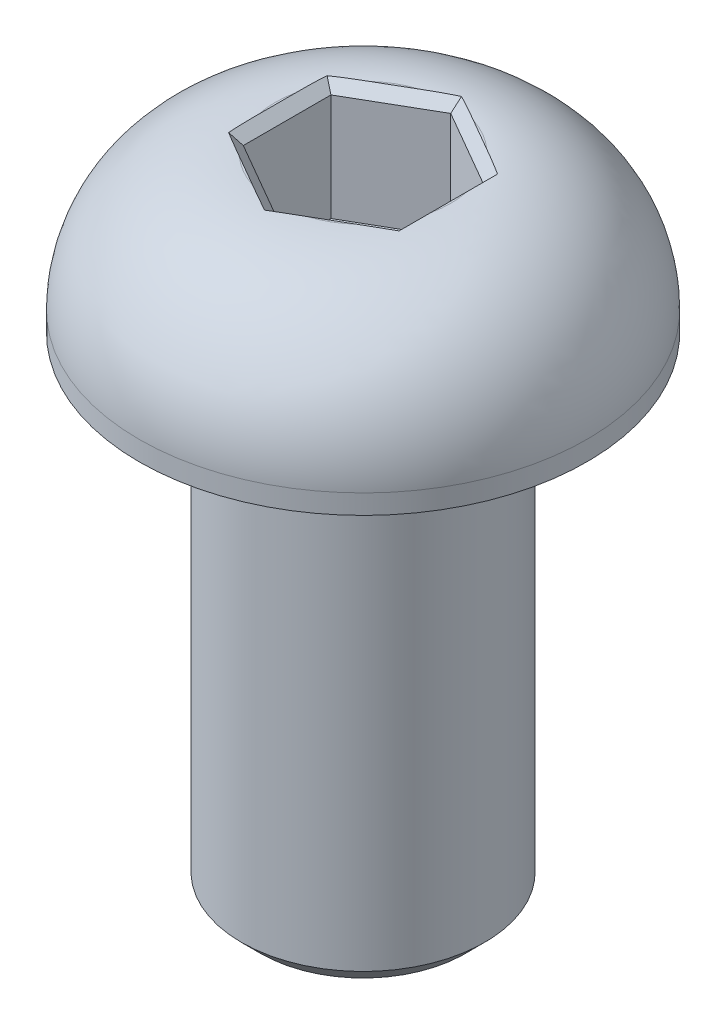
ISO-10303-21;
HEADER;
FILE_DESCRIPTION(('STEP AP214'),'2;1');
FILE_NAME('part.step','',(''),(''),'','','');
FILE_SCHEMA(('AUTOMOTIVE_DESIGN { 1 0 10303 214 1 1 1 1 }'));
ENDSEC;
DATA;
#1=APPLICATION_CONTEXT('core data for automotive mechanical design processes');
#2=APPLICATION_PROTOCOL_DEFINITION('international standard','automotive_design',2000,#1);
#3=PRODUCT_CONTEXT('',#1,'mechanical');
#4=PRODUCT('Part','Part','',(#3));
#5=PRODUCT_RELATED_PRODUCT_CATEGORY('part','',(#4));
#6=PRODUCT_DEFINITION_FORMATION('','',#4);
#7=PRODUCT_DEFINITION_CONTEXT('part definition',#1,'design');
#8=PRODUCT_DEFINITION('design','',#6,#7);
#9=PRODUCT_DEFINITION_SHAPE('','',#8);
#10=(LENGTH_UNIT() NAMED_UNIT(*) SI_UNIT(.MILLI.,.METRE.));
#11=(NAMED_UNIT(*) PLANE_ANGLE_UNIT() SI_UNIT($,.RADIAN.));
#12=(NAMED_UNIT(*) SI_UNIT($,.STERADIAN.) SOLID_ANGLE_UNIT());
#13=UNCERTAINTY_MEASURE_WITH_UNIT(LENGTH_MEASURE(1.E-05),#10,'distance_accuracy_value','');
#14=(GEOMETRIC_REPRESENTATION_CONTEXT(3) GLOBAL_UNCERTAINTY_ASSIGNED_CONTEXT((#13)) GLOBAL_UNIT_ASSIGNED_CONTEXT((#10,
#11,#12)) REPRESENTATION_CONTEXT('',''));
#15=CARTESIAN_POINT('',(0.,0.,0.));
#16=DIRECTION('',(0.,0.,1.));
#17=DIRECTION('',(1.,0.,0.));
#18=AXIS2_PLACEMENT_3D('',#15,#16,#17);
#19=CARTESIAN_POINT('',(2.23520000000001,0.,0.));
#20=DIRECTION('',(0.707106781186548,-0.707106781186548,0.));
#21=DIRECTION('',(0.707106781186548,0.707106781186548,0.));
#22=AXIS2_PLACEMENT_3D('',#19,#20,#21);
#23=PLANE('',#22);
#24=CARTESIAN_POINT('',(2.22399670617115,-0.0112032938288589,-1.28402509698474));
#25=CARTESIAN_POINT('',(2.22841135106006,-0.00678864893879202,-1.16554783242049));
#26=CARTESIAN_POINT('',(2.23110879962653,-0.00409120037287481,-1.04699639920592));
#27=CARTESIAN_POINT('',(2.23438345381033,-0.000816546190287566,-0.809850635730226));
#28=CARTESIAN_POINT('',(2.23496107929993,-0.000238920701353471,-0.691256318617618));
#29=CARTESIAN_POINT('',(2.23515898063711,-4.10193631359054E-05,-0.557099307855873));
#30=CARTESIAN_POINT('',(2.2351750070183,-2.49929817972814E-05,-0.541528977035806));
#31=CARTESIAN_POINT('',(2.23519554632668,-4.453673235457E-06,-0.510387894564967));
#32=CARTESIAN_POINT('',(2.23520005895435,5.89544553829237E-08,-0.494817142913786));
#33=CARTESIAN_POINT('',(2.23520000000001,0.,-0.479246241508439));
#34=B_SPLINE_CURVE_WITH_KNOTS('',3,(#24,#25,#26,#27,#28,#29,#30,#31,#32,#33),.UNSPECIFIED.,.F.,
.F.,(4,2,2,2,4),(0.,0.355828535544475,0.711586588509343,0.758297774785068,0.805010176248268),.UNSPECIFIED.);
#35=CARTESIAN_POINT('',(2.22399670617115,-0.0112032938288588,-1.28402509698474));
#36=VERTEX_POINT('',#35);
#37=CARTESIAN_POINT('',(2.23520000000001,0.,-0.479246241508439));
#38=VERTEX_POINT('',#37);
#39=EDGE_CURVE('E128',#36,#38,#34,.T.);
#40=ORIENTED_EDGE('',*,*,#39,.F.);
#41=DIRECTION('',(-0.654653670707975,-0.654653670707977,0.37796447300923));
#42=VECTOR('',#41,1.);
#43=CARTESIAN_POINT('',(2.22399670617115,-0.0112032938288602,-1.28402509698474));
#44=LINE('',#43,#42);
#45=CARTESIAN_POINT('',(1.98120000000001,-0.254,-1.14384635331848));
#46=VERTEX_POINT('',#45);
#47=EDGE_CURVE('E136',#36,#46,#44,.T.);
#48=ORIENTED_EDGE('',*,*,#47,.T.);
#49=DIRECTION('',(0.,0.,1.));
#50=VECTOR('',#49,1.);
#51=CARTESIAN_POINT('',(1.98120000000001,-0.254000000000001,-1.14384635331848));
#52=LINE('',#51,#50);
#53=CARTESIAN_POINT('',(1.98120000000001,-0.254000000000001,1.14384635331849));
#54=VERTEX_POINT('',#53);
#55=EDGE_CURVE('E223',#54,#46,#52,.F.);
#56=ORIENTED_EDGE('',*,*,#55,.F.);
#57=DIRECTION('',(0.654653670707976,0.654653670707977,0.377964473009229));
#58=VECTOR('',#57,1.);
#59=CARTESIAN_POINT('',(1.98120000000001,-0.254,1.14384635331849));
#60=LINE('',#59,#58);
#61=CARTESIAN_POINT('',(2.22399670617115,-0.0112032938288603,1.28402509698475));
#62=VERTEX_POINT('',#61);
#63=EDGE_CURVE('E186',#54,#62,#60,.T.);
#64=ORIENTED_EDGE('',*,*,#63,.T.);
#65=CARTESIAN_POINT('',(2.23520000000001,0.,0.479246241508439));
#66=CARTESIAN_POINT('',(2.23519208788843,-7.91211009480866E-06,0.597800715305684));
#67=CARTESIAN_POINT('',(2.23495349481257,-0.000246505186659069,0.716402395238539));
#68=CARTESIAN_POINT('',(2.23270241259373,-0.0024975874070557,0.953513904044191));
#69=CARTESIAN_POINT('',(2.23069069534341,-0.00450930465823549,1.0720237504285));
#70=CARTESIAN_POINT('',(2.2266687677988,-0.00853123220151168,1.20604578947156));
#71=CARTESIAN_POINT('',(2.22617387547318,-0.00902612452694535,1.22164382162402));
#72=CARTESIAN_POINT('',(2.22512799617112,-0.0100720038287759,1.25283701736964));
#73=CARTESIAN_POINT('',(2.22457700598046,-0.0106229940193991,1.26843218074709));
#74=CARTESIAN_POINT('',(2.22399670617115,-0.0112032938288599,1.28402509698475));
#75=B_SPLINE_CURVE_WITH_KNOTS('',3,(#65,#66,#67,#68,#69,#70,#71,#72,#73,#74),.UNSPECIFIED.,.F.,
.F.,(4,2,2,2,4),(0.,0.355743000096769,0.711331211340007,0.75817210537775,0.805015684759264),.UNSPECIFIED.);
#76=CARTESIAN_POINT('',(2.23520000000001,0.,0.479246241508439));
#77=VERTEX_POINT('',#76);
#78=EDGE_CURVE('E144',#77,#62,#75,.T.);
#79=ORIENTED_EDGE('',*,*,#78,.F.);
#80=DIRECTION('',(0.,0.,1.));
#81=VECTOR('',#80,1.);
#82=CARTESIAN_POINT('',(2.23520000000001,0.,0.));
#83=LINE('',#82,#81);
#84=EDGE_CURVE('E143',#38,#77,#83,.T.);
#85=ORIENTED_EDGE('',*,*,#84,.F.);
#86=EDGE_LOOP('',(#40,#48,#56,#64,#79,#85));
#87=FACE_BOUND('',#86,.T.);
#88=ADVANCED_FACE('F16',(#87),#23,.F.);
#89=CARTESIAN_POINT('',(1.1176,0.,1.93573998253899));
#90=DIRECTION('',(0.353553390593274,-0.707106781186548,0.612372435695794));
#91=DIRECTION('',(0.,-0.654653670707977,-0.755928946018455));
#92=AXIS2_PLACEMENT_3D('',#89,#90,#91);
#93=PLANE('',#92);
#94=CARTESIAN_POINT('',(0.70256058018549,0.,2.1753631032932));
#95=CARTESIAN_POINT('',(0.599885438088986,-7.91211009276454E-06,2.23463348810219));
#96=CARTESIAN_POINT('',(0.497054073797695,-0.000246505186657969,2.29372770040376));
#97=CARTESIAN_POINT('',(0.290583942532928,-0.00249758740705674,2.41033396041907));
#98=CARTESIAN_POINT('',(0.186945546340366,-0.00450930465823774,2.46784668536722));
#99=CARTESIAN_POINT('',(0.0688680920897798,-0.00853123220151213,2.53137461346293));
#100=CARTESIAN_POINT('',(0.0551123538338917,-0.00902612452694555,2.53874504021303));
#101=CARTESIAN_POINT('',(0.0275753142419301,-0.010072003828776,2.55343588004097));
#102=CARTESIAN_POINT('',(0.0137940114855596,-0.0106229940193992,2.56075629022735));
#103=CARTESIAN_POINT('',(0.,-0.0112032938288605,2.56805019396951));
#104=B_SPLINE_CURVE_WITH_KNOTS('',3,(#94,#95,#96,#97,#98,#99,#100,#101,#102,#103),.UNSPECIFIED.,
.F.,.F.,(4,2,2,2,4),(0.,0.35574300009677,0.711331211340008,0.758172105377752,0.805015684759268),.UNSPECIFIED.);
#105=CARTESIAN_POINT('',(0.70256058018549,0.,2.1753631032932));
#106=VERTEX_POINT('',#105);
#107=CARTESIAN_POINT('',(0.,-0.0112032938288596,2.5680501939695));
#108=VERTEX_POINT('',#107);
#109=EDGE_CURVE('E178',#106,#108,#104,.T.);
#110=ORIENTED_EDGE('',*,*,#109,.F.);
#111=DIRECTION('',(-0.866025403784439,0.,0.5));
#112=VECTOR('',#111,1.);
#113=CARTESIAN_POINT('',(1.53263941981452,0.,1.69611686178477));
#114=LINE('',#113,#112);
#115=CARTESIAN_POINT('',(1.53263941981452,0.,1.69611686178477));
#116=VERTEX_POINT('',#115);
#117=EDGE_CURVE('E181',#116,#106,#114,.T.);
#118=ORIENTED_EDGE('',*,*,#117,.F.);
#119=CARTESIAN_POINT('',(2.22399670617115,-0.01120329382886,1.28402509698475));
#120=CARTESIAN_POINT('',(2.12359970773207,-0.00678864893879016,1.34708692388936));
#121=CARTESIAN_POINT('',(2.02227987919643,-0.00409120037287398,1.40869869948061));
#122=CARTESIAN_POINT('',(1.81854295071853,-0.000816546190289203,1.53010751493024));
#123=CARTESIAN_POINT('',(1.71612607209935,-0.00023892070135656,1.58990491183442));
#124=CARTESIAN_POINT('',(1.60004164335248,-4.10193631366739E-05,1.65715480480073));
#125=CARTESIAN_POINT('',(1.58656535450756,-2.49929817977188E-05,1.664953849464));
#126=CARTESIAN_POINT('',(1.55960665564066,-4.4536732350329E-06,1.68054217826226));
#127=CARTESIAN_POINT('',(1.54612424546854,5.8954456337414E-08,1.68833146213805));
#128=CARTESIAN_POINT('',(1.53263941981452,0.,1.69611686178477));
#129=B_SPLINE_CURVE_WITH_KNOTS('',3,(#119,#120,#121,#122,#123,#124,#125,#126,#127,#128),
.UNSPECIFIED.,.F.,.F.,(4,2,2,2,4),(0.,0.355828535544475,0.711586588509342,0.758297774785077,
0.805010176248287),.UNSPECIFIED.);
#130=EDGE_CURVE('E183',#62,#116,#129,.T.);
#131=ORIENTED_EDGE('',*,*,#130,.F.);
#132=ORIENTED_EDGE('',*,*,#63,.F.);
#133=DIRECTION('',(-0.866025403784439,0.,0.5));
#134=VECTOR('',#133,1.);
#135=CARTESIAN_POINT('',(1.98120000000001,-0.254000000000001,1.14384635331849));
#136=LINE('',#135,#134);
#137=CARTESIAN_POINT('',(0.,-0.254000000000001,2.28769270663698));
#138=VERTEX_POINT('',#137);
#139=EDGE_CURVE('E225',#138,#54,#136,.F.);
#140=ORIENTED_EDGE('',*,*,#139,.F.);
#141=DIRECTION('',(0.,-0.654653670707977,-0.755928946018455));
#142=VECTOR('',#141,1.);
#143=CARTESIAN_POINT('',(0.,-0.319314285714288,2.21227426575883));
#144=LINE('',#143,#142);
#145=EDGE_CURVE('E175',#138,#108,#144,.F.);
#146=ORIENTED_EDGE('',*,*,#145,.T.);
#147=EDGE_LOOP('',(#110,#118,#131,#132,#140,#146));
#148=FACE_BOUND('',#147,.T.);
#149=ADVANCED_FACE('F483',(#148),#93,.F.);
#150=CARTESIAN_POINT('',(-1.1176,0.,1.93573998253898));
#151=DIRECTION('',(-0.353553390593274,-0.707106781186548,0.612372435695794));
#152=DIRECTION('',(0.,-0.654653670707977,-0.755928946018455));
#153=AXIS2_PLACEMENT_3D('',#150,#151,#152);
#154=PLANE('',#153);
#155=CARTESIAN_POINT('',(-1.53263941981454,0.,1.69611686178475));
#156=CARTESIAN_POINT('',(-1.63530664979946,-7.91211009375364E-06,1.6368327727965));
#157=CARTESIAN_POINT('',(-1.73789942101489,-0.000246505186658447,1.57732530516521));
#158=CARTESIAN_POINT('',(-1.94211847006083,-0.00249758740705628,1.45682005637487));
#159=CARTESIAN_POINT('',(-2.04374514900307,-0.00450930465823684,1.3958229349387));
#160=CARTESIAN_POINT('',(-2.15780067570904,-0.00853123220151208,1.32532882399136));
#161=CARTESIAN_POINT('',(-2.17106152163929,-0.0090261245269454,1.31710121858901));
#162=CARTESIAN_POINT('',(-2.19755268192919,-0.0100720038287754,1.30059886267133));
#163=CARTESIAN_POINT('',(-2.21078299449489,-0.0106229940193984,1.29232410948026));
#164=CARTESIAN_POINT('',(-2.22399670617113,-0.011203293828859,1.28402509698476));
#165=B_SPLINE_CURVE_WITH_KNOTS('',3,(#155,#156,#157,#158,#159,#160,#161,#162,#163,#164),
.UNSPECIFIED.,.F.,.F.,(4,2,2,2,4),(0.,0.35574300009677,0.711331211340009,0.758172105377731,
0.805015684759225),.UNSPECIFIED.);
#166=CARTESIAN_POINT('',(-1.53263941981454,0.,1.69611686178475));
#167=VERTEX_POINT('',#166);
#168=CARTESIAN_POINT('',(-2.22399670617113,-0.0112032938288591,1.28402509698476));
#169=VERTEX_POINT('',#168);
#170=EDGE_CURVE('E167',#167,#169,#165,.T.);
#171=ORIENTED_EDGE('',*,*,#170,.F.);
#172=DIRECTION('',(-0.866025403784439,0.,-0.499999999999999));
#173=VECTOR('',#172,1.);
#174=CARTESIAN_POINT('',(-0.702560580185463,0.,2.17536310329321));
#175=LINE('',#174,#173);
#176=CARTESIAN_POINT('',(-0.702560580185463,0.,2.17536310329321));
#177=VERTEX_POINT('',#176);
#178=EDGE_CURVE('E170',#177,#167,#175,.T.);
#179=ORIENTED_EDGE('',*,*,#178,.F.);
#180=CARTESIAN_POINT('',(0.,-0.0112032938288597,2.5680501939695));
#181=CARTESIAN_POINT('',(-0.104811643327982,-0.0067886489387911,2.51263475630986));
#182=CARTESIAN_POINT('',(-0.208828920430089,-0.00409120037287428,2.45569509868654));
#183=CARTESIAN_POINT('',(-0.415840503091795,-0.000816546190288205,2.33995815066047));
#184=CARTESIAN_POINT('',(-0.518835007200582,-0.000238920701354906,2.28116123045204));
#185=CARTESIAN_POINT('',(-0.635117337284623,-4.10193631363332E-05,2.21425411265661));
#186=CARTESIAN_POINT('',(-0.648609652510724,-2.49929817975634E-05,2.20648282649982));
#187=CARTESIAN_POINT('',(-0.675588890686008,-4.45367323519006E-06,2.19093007282723));
#188=CARTESIAN_POINT('',(-0.68907581348578,5.89544560530142E-08,2.18314860505184));
#189=CARTESIAN_POINT('',(-0.702560580185463,0.,2.17536310329321));
#190=B_SPLINE_CURVE_WITH_KNOTS('',3,(#180,#181,#182,#183,#184,#185,#186,#187,#188,#189),
.UNSPECIFIED.,.F.,.F.,(4,2,2,2,4),(0.,0.355828535544474,0.711586588509341,0.758297774785064,
0.805010176248262),.UNSPECIFIED.);
#191=EDGE_CURVE('E172',#108,#177,#190,.T.);
#192=ORIENTED_EDGE('',*,*,#191,.F.);
#193=ORIENTED_EDGE('',*,*,#145,.F.);
#194=DIRECTION('',(-0.866025403784439,0.,-0.5));
#195=VECTOR('',#194,1.);
#196=CARTESIAN_POINT('',(0.,-0.254000000000001,2.28769270663698));
#197=LINE('',#196,#195);
#198=CARTESIAN_POINT('',(-1.98119999999999,-0.254000000000001,1.14384635331849));
#199=VERTEX_POINT('',#198);
#200=EDGE_CURVE('E212',#199,#138,#197,.F.);
#201=ORIENTED_EDGE('',*,*,#200,.F.);
#202=DIRECTION('',(-0.654653670707976,0.654653670707976,0.377964473009232));
#203=VECTOR('',#202,1.);
#204=CARTESIAN_POINT('',(-1.98119999999999,-0.254,1.14384635331849));
#205=LINE('',#204,#203);
#206=EDGE_CURVE('E151',#199,#169,#205,.T.);
#207=ORIENTED_EDGE('',*,*,#206,.T.);
#208=EDGE_LOOP('',(#171,#179,#192,#193,#201,#207));
#209=FACE_BOUND('',#208,.T.);
#210=ADVANCED_FACE('F451',(#209),#154,.F.);
#211=CARTESIAN_POINT('',(1.1176,0.,-1.93573998253898));
#212=DIRECTION('',(0.353553390593273,-0.707106781186548,-0.612372435695794));
#213=DIRECTION('',(0.,0.654653670707977,-0.755928946018455));
#214=AXIS2_PLACEMENT_3D('',#211,#212,#213);
#215=PLANE('',#214);
#216=CARTESIAN_POINT('',(1.53263941981456,0.,-1.69611686178473));
#217=CARTESIAN_POINT('',(1.63530664979948,-7.91211009299081E-06,-1.63683277279648));
#218=CARTESIAN_POINT('',(1.73789942101491,-0.000246505186658079,-1.5773253051652));
#219=CARTESIAN_POINT('',(1.94211847006085,-0.0024975874070567,-1.45682005637485));
#220=CARTESIAN_POINT('',(2.04374514900309,-0.00450930465823765,-1.39582293493869));
#221=CARTESIAN_POINT('',(2.15780067570906,-0.00853123220151226,-1.32532882399135));
#222=CARTESIAN_POINT('',(2.17106152163931,-0.0090261245269455,-1.31710121858899));
#223=CARTESIAN_POINT('',(2.1975526819292,-0.0100720038287759,-1.30059886267131));
#224=CARTESIAN_POINT('',(2.21078299449491,-0.0106229940193993,-1.29232410948025));
#225=CARTESIAN_POINT('',(2.22399670617115,-0.0112032938288609,-1.28402509698475));
#226=B_SPLINE_CURVE_WITH_KNOTS('',3,(#216,#217,#218,#219,#220,#221,#222,#223,#224,#225),
.UNSPECIFIED.,.F.,.F.,(4,2,2,2,4),(0.,0.355743000096769,0.711331211340008,0.758172105377731,
0.805015684759225),.UNSPECIFIED.);
#227=CARTESIAN_POINT('',(1.53263941981456,0.,-1.69611686178473));
#228=VERTEX_POINT('',#227);
#229=EDGE_CURVE('E122',#228,#36,#226,.T.);
#230=ORIENTED_EDGE('',*,*,#229,.F.);
#231=DIRECTION('',(0.866025403784439,0.,0.499999999999999));
#232=VECTOR('',#231,1.);
#233=CARTESIAN_POINT('',(0.702560580185438,0.,-2.17536310329322));
#234=LINE('',#233,#232);
#235=CARTESIAN_POINT('',(0.702560580185438,0.,-2.17536310329322));
#236=VERTEX_POINT('',#235);
#237=EDGE_CURVE('E137',#236,#228,#234,.T.);
#238=ORIENTED_EDGE('',*,*,#237,.F.);
#239=CARTESIAN_POINT('',(0.,-0.0112032938288587,-2.56805019396949));
#240=CARTESIAN_POINT('',(0.104811643328,-0.00678864893879505,-2.51263475630986));
#241=CARTESIAN_POINT('',(0.208828920430105,-0.00409120037287619,-2.45569509868653));
#242=CARTESIAN_POINT('',(0.415840503091804,-0.000816546190285477,-2.33995815066046));
#243=CARTESIAN_POINT('',(0.518835007200587,-0.000238920701349571,-2.28116123045201));
#244=CARTESIAN_POINT('',(0.635117337284628,-4.10193631353533E-05,-2.21425411265659));
#245=CARTESIAN_POINT('',(0.648609652510723,-2.49929817972032E-05,-2.20648282649981));
#246=CARTESIAN_POINT('',(0.675588890685995,-4.45367323554173E-06,-2.19093007282724));
#247=CARTESIAN_POINT('',(0.689075813485762,5.89544556091054E-08,-2.18314860505184));
#248=CARTESIAN_POINT('',(0.702560580185438,0.,-2.17536310329322));
#249=B_SPLINE_CURVE_WITH_KNOTS('',3,(#239,#240,#241,#242,#243,#244,#245,#246,#247,#248),
.UNSPECIFIED.,.F.,.F.,(4,2,2,2,4),(0.,0.355828535544475,0.711586588509342,0.758297774785043,
0.80501017624822),.UNSPECIFIED.);
#250=CARTESIAN_POINT('',(0.,-0.0112032938288582,-2.56805019396949));
#251=VERTEX_POINT('',#250);
#252=EDGE_CURVE('E162',#251,#236,#249,.T.);
#253=ORIENTED_EDGE('',*,*,#252,.F.);
#254=DIRECTION('',(0.,0.654653670707977,-0.755928946018455));
#255=VECTOR('',#254,1.);
#256=CARTESIAN_POINT('',(0.,-0.319314285714283,-2.21227426575883));
#257=LINE('',#256,#255);
#258=CARTESIAN_POINT('',(0.,-0.254000000000001,-2.28769270663696));
#259=VERTEX_POINT('',#258);
#260=EDGE_CURVE('E165',#259,#251,#257,.T.);
#261=ORIENTED_EDGE('',*,*,#260,.F.);
#262=DIRECTION('',(0.866025403784439,0.,0.5));
#263=VECTOR('',#262,1.);
#264=CARTESIAN_POINT('',(0.,-0.254000000000001,-2.28769270663697));
#265=LINE('',#264,#263);
#266=EDGE_CURVE('E149',#46,#259,#265,.F.);
#267=ORIENTED_EDGE('',*,*,#266,.F.);
#268=ORIENTED_EDGE('',*,*,#47,.F.);
#269=EDGE_LOOP('',(#230,#238,#253,#261,#267,#268));
#270=FACE_BOUND('',#269,.T.);
#271=ADVANCED_FACE('F147',(#270),#215,.F.);
#272=CARTESIAN_POINT('',(-2.23519999999999,0.,0.));
#273=DIRECTION('',(-0.707106781186548,-0.707106781186548,0.));
#274=DIRECTION('',(0.707106781186548,-0.707106781186548,0.));
#275=AXIS2_PLACEMENT_3D('',#272,#273,#274);
#276=PLANE('',#275);
#277=CARTESIAN_POINT('',(-2.23519999999999,0.,-0.479246241508528));
#278=CARTESIAN_POINT('',(-2.2351920878884,-7.91211009243978E-06,-0.597800715305773));
#279=CARTESIAN_POINT('',(-2.23495349481255,-0.000246505186657994,-0.716402395238628));
#280=CARTESIAN_POINT('',(-2.23270241259371,-0.00249758740705764,-0.95351390404428));
#281=CARTESIAN_POINT('',(-2.23069069534339,-0.00450930465823917,-1.07202375042859));
#282=CARTESIAN_POINT('',(-2.22666876779878,-0.00853123220151316,-1.20604578947163));
#283=CARTESIAN_POINT('',(-2.22617387547316,-0.00902612452694601,-1.22164382162407));
#284=CARTESIAN_POINT('',(-2.2251279961711,-0.0100720038287753,-1.25283701736966));
#285=CARTESIAN_POINT('',(-2.22457700598044,-0.010622994019398,-1.2684321807471));
#286=CARTESIAN_POINT('',(-2.22399670617113,-0.0112032938288586,-1.28402509698474));
#287=B_SPLINE_CURVE_WITH_KNOTS('',3,(#277,#278,#279,#280,#281,#282,#283,#284,#285,#286),
.UNSPECIFIED.,.F.,.F.,(4,2,2,2,4),(0.,0.355743000096769,0.711331211340008,0.758172105377701,
0.805015684759166),.UNSPECIFIED.);
#288=CARTESIAN_POINT('',(-2.23519999999999,0.,-0.479246241508528));
#289=VERTEX_POINT('',#288);
#290=CARTESIAN_POINT('',(-2.22399670617113,-0.0112032938288586,-1.28402509698474));
#291=VERTEX_POINT('',#290);
#292=EDGE_CURVE('E416',#289,#291,#287,.T.);
#293=ORIENTED_EDGE('',*,*,#292,.F.);
#294=DIRECTION('',(0.,0.,1.));
#295=VECTOR('',#294,1.);
#296=CARTESIAN_POINT('',(-2.23519999999999,0.,0.));
#297=LINE('',#296,#295);
#298=CARTESIAN_POINT('',(-2.23519999999999,0.,0.479246241508528));
#299=VERTEX_POINT('',#298);
#300=EDGE_CURVE('E419',#299,#289,#297,.F.);
#301=ORIENTED_EDGE('',*,*,#300,.F.);
#302=CARTESIAN_POINT('',(-2.22399670617113,-0.0112032938288589,1.28402509698476));
#303=CARTESIAN_POINT('',(-2.22841135106005,-0.00678864893879358,1.16554783242051));
#304=CARTESIAN_POINT('',(-2.23110879962651,-0.00409120037287541,1.04699639920593));
#305=CARTESIAN_POINT('',(-2.2343834538103,-0.000816546190286238,0.809850635730243));
#306=CARTESIAN_POINT('',(-2.2349610792999,-0.000238920701351198,0.691256318617635));
#307=CARTESIAN_POINT('',(-2.23515898063709,-4.10193631354858E-05,0.557099307855903));
#308=CARTESIAN_POINT('',(-2.23517500701828,-2.49929817971261E-05,0.541528977035847));
#309=CARTESIAN_POINT('',(-2.23519554632667,-4.45367323561328E-06,0.510387894565033));
#310=CARTESIAN_POINT('',(-2.23520005895433,5.89544551794439E-08,0.494817142913863));
#311=CARTESIAN_POINT('',(-2.23519999999999,0.,0.479246241508528));
#312=B_SPLINE_CURVE_WITH_KNOTS('',3,(#302,#303,#304,#305,#306,#307,#308,#309,#310,#311),
.UNSPECIFIED.,.F.,.F.,(4,2,2,2,4),(0.,0.355828535544475,0.711586588509344,0.758297774785032,
0.805010176248196),.UNSPECIFIED.);
#313=EDGE_CURVE('E154',#169,#299,#312,.T.);
#314=ORIENTED_EDGE('',*,*,#313,.F.);
#315=ORIENTED_EDGE('',*,*,#206,.F.);
#316=DIRECTION('',(0.,0.,-1.));
#317=VECTOR('',#316,1.);
#318=CARTESIAN_POINT('',(-1.98119999999999,-0.254000000000001,1.14384635331849));
#319=LINE('',#318,#317);
#320=CARTESIAN_POINT('',(-1.98119999999999,-0.254,-1.14384635331848));
#321=VERTEX_POINT('',#320);
#322=EDGE_CURVE('E194',#321,#199,#319,.F.);
#323=ORIENTED_EDGE('',*,*,#322,.F.);
#324=DIRECTION('',(0.654653670707976,-0.654653670707976,0.377964473009232));
#325=VECTOR('',#324,1.);
#326=CARTESIAN_POINT('',(-2.22399670617113,-0.0112032938288584,-1.28402509698474));
#327=LINE('',#326,#325);
#328=EDGE_CURVE('E226',#291,#321,#327,.T.);
#329=ORIENTED_EDGE('',*,*,#328,.F.);
#330=EDGE_LOOP('',(#293,#301,#314,#315,#323,#329));
#331=FACE_BOUND('',#330,.T.);
#332=ADVANCED_FACE('F439',(#331),#276,.F.);
#333=CARTESIAN_POINT('',(1.98120000000001,-3.048,-1.14384635331848));
#334=DIRECTION('',(-1.,0.,0.));
#335=DIRECTION('',(0.,0.,1.));
#336=AXIS2_PLACEMENT_3D('',#333,#334,#335);
#337=PLANE('',#336);
#338=DIRECTION('',(0.,1.,0.));
#339=VECTOR('',#338,1.);
#340=CARTESIAN_POINT('',(1.98120000000001,-3.048,-1.14384635331848));
#341=LINE('',#340,#339);
#342=CARTESIAN_POINT('',(1.98120000000001,-3.048,-1.14384635331848));
#343=VERTEX_POINT('',#342);
#344=EDGE_CURVE('E230',#343,#46,#341,.T.);
#345=ORIENTED_EDGE('',*,*,#344,.F.);
#346=DIRECTION('',(0.,0.,-1.));
#347=VECTOR('',#346,1.);
#348=CARTESIAN_POINT('',(1.98120000000001,-3.048,0.));
#349=LINE('',#348,#347);
#350=CARTESIAN_POINT('',(1.98120000000001,-3.048,1.14384635331849));
#351=VERTEX_POINT('',#350);
#352=EDGE_CURVE('E409',#343,#351,#349,.F.);
#353=ORIENTED_EDGE('',*,*,#352,.T.);
#354=DIRECTION('',(0.,1.,0.));
#355=VECTOR('',#354,1.);
#356=CARTESIAN_POINT('',(1.98120000000001,-3.048,1.14384635331849));
#357=LINE('',#356,#355);
#358=EDGE_CURVE('E216',#54,#351,#357,.F.);
#359=ORIENTED_EDGE('',*,*,#358,.F.);
#360=ORIENTED_EDGE('',*,*,#55,.T.);
#361=EDGE_LOOP('',(#345,#353,#359,#360));
#362=FACE_BOUND('',#361,.T.);
#363=ADVANCED_FACE('F444',(#362),#337,.T.);
#364=CARTESIAN_POINT('',(1.98120000000001,-3.048,1.14384635331849));
#365=DIRECTION('',(-0.5,0.,-0.866025403784439));
#366=DIRECTION('',(-0.866025403784439,0.,0.5));
#367=AXIS2_PLACEMENT_3D('',#364,#365,#366);
#368=PLANE('',#367);
#369=ORIENTED_EDGE('',*,*,#358,.T.);
#370=DIRECTION('',(-0.866025403784439,0.,0.5));
#371=VECTOR('',#370,1.);
#372=CARTESIAN_POINT('',(1.98120000000001,-3.048,1.14384635331849));
#373=LINE('',#372,#371);
#374=CARTESIAN_POINT('',(0.,-3.048,2.28769270663698));
#375=VERTEX_POINT('',#374);
#376=EDGE_CURVE('E407',#351,#375,#373,.T.);
#377=ORIENTED_EDGE('',*,*,#376,.T.);
#378=DIRECTION('',(0.,1.,0.));
#379=VECTOR('',#378,1.);
#380=CARTESIAN_POINT('',(0.,-3.048,2.28769270663698));
#381=LINE('',#380,#379);
#382=EDGE_CURVE('E215',#138,#375,#381,.F.);
#383=ORIENTED_EDGE('',*,*,#382,.F.);
#384=ORIENTED_EDGE('',*,*,#139,.T.);
#385=EDGE_LOOP('',(#369,#377,#383,#384));
#386=FACE_BOUND('',#385,.T.);
#387=ADVANCED_FACE('F689',(#386),#368,.T.);
#388=CARTESIAN_POINT('',(0.,-3.048,2.28769270663698));
#389=DIRECTION('',(0.5,0.,-0.866025403784439));
#390=DIRECTION('',(-0.866025403784439,0.,-0.5));
#391=AXIS2_PLACEMENT_3D('',#388,#389,#390);
#392=PLANE('',#391);
#393=ORIENTED_EDGE('',*,*,#382,.T.);
#394=DIRECTION('',(-0.866025403784438,0.,-0.500000000000001));
#395=VECTOR('',#394,1.);
#396=CARTESIAN_POINT('',(0.,-3.048,2.28769270663698));
#397=LINE('',#396,#395);
#398=CARTESIAN_POINT('',(-1.98119999999999,-3.048,1.14384635331849));
#399=VERTEX_POINT('',#398);
#400=EDGE_CURVE('E238',#375,#399,#397,.T.);
#401=ORIENTED_EDGE('',*,*,#400,.T.);
#402=DIRECTION('',(0.,1.,0.));
#403=VECTOR('',#402,1.);
#404=CARTESIAN_POINT('',(-1.98119999999999,-3.048,1.14384635331849));
#405=LINE('',#404,#403);
#406=EDGE_CURVE('E197',#199,#399,#405,.F.);
#407=ORIENTED_EDGE('',*,*,#406,.F.);
#408=ORIENTED_EDGE('',*,*,#200,.T.);
#409=EDGE_LOOP('',(#393,#401,#407,#408));
#410=FACE_BOUND('',#409,.T.);
#411=ADVANCED_FACE('F679',(#410),#392,.T.);
#412=CARTESIAN_POINT('',(0.,-3.048,-2.28769270663697));
#413=DIRECTION('',(-0.5,0.,0.866025403784439));
#414=DIRECTION('',(0.866025403784439,0.,0.5));
#415=AXIS2_PLACEMENT_3D('',#412,#413,#414);
#416=PLANE('',#415);
#417=DIRECTION('',(0.,1.,0.));
#418=VECTOR('',#417,1.);
#419=CARTESIAN_POINT('',(0.,-3.048,-2.28769270663697));
#420=LINE('',#419,#418);
#421=CARTESIAN_POINT('',(0.,-3.048,-2.28769270663697));
#422=VERTEX_POINT('',#421);
#423=EDGE_CURVE('E204',#422,#259,#420,.T.);
#424=ORIENTED_EDGE('',*,*,#423,.F.);
#425=DIRECTION('',(0.866025403784439,0.,0.5));
#426=VECTOR('',#425,1.);
#427=CARTESIAN_POINT('',(0.,-3.048,-2.28769270663697));
#428=LINE('',#427,#426);
#429=EDGE_CURVE('E411',#422,#343,#428,.T.);
#430=ORIENTED_EDGE('',*,*,#429,.T.);
#431=ORIENTED_EDGE('',*,*,#344,.T.);
#432=ORIENTED_EDGE('',*,*,#266,.T.);
#433=EDGE_LOOP('',(#424,#430,#431,#432));
#434=FACE_BOUND('',#433,.T.);
#435=ADVANCED_FACE('F669',(#434),#416,.T.);
#436=CARTESIAN_POINT('',(-1.98119999999999,-3.048,1.14384635331849));
#437=DIRECTION('',(1.,0.,0.));
#438=DIRECTION('',(0.,0.,-1.));
#439=AXIS2_PLACEMENT_3D('',#436,#437,#438);
#440=PLANE('',#439);
#441=ORIENTED_EDGE('',*,*,#406,.T.);
#442=DIRECTION('',(0.,0.,-1.));
#443=VECTOR('',#442,1.);
#444=CARTESIAN_POINT('',(-1.98119999999999,-3.048,0.));
#445=LINE('',#444,#443);
#446=CARTESIAN_POINT('',(-1.98119999999999,-3.048,-1.14384635331848));
#447=VERTEX_POINT('',#446);
#448=EDGE_CURVE('E220',#399,#447,#445,.T.);
#449=ORIENTED_EDGE('',*,*,#448,.T.);
#450=DIRECTION('',(0.,1.,0.));
#451=VECTOR('',#450,1.);
#452=CARTESIAN_POINT('',(-1.98119999999999,-3.048,-1.14384635331848));
#453=LINE('',#452,#451);
#454=EDGE_CURVE('E200',#321,#447,#453,.F.);
#455=ORIENTED_EDGE('',*,*,#454,.F.);
#456=ORIENTED_EDGE('',*,*,#322,.T.);
#457=EDGE_LOOP('',(#441,#449,#455,#456));
#458=FACE_BOUND('',#457,.T.);
#459=ADVANCED_FACE('F659',(#458),#440,.T.);
#460=CARTESIAN_POINT('',(-3.96239999999999,-3.048,0.));
#461=DIRECTION('',(0.,-1.,0.));
#462=DIRECTION('',(0.,0.,-1.));
#463=AXIS2_PLACEMENT_3D('',#460,#461,#462);
#464=PLANE('',#463);
#465=ORIENTED_EDGE('',*,*,#376,.F.);
#466=ORIENTED_EDGE('',*,*,#352,.F.);
#467=ORIENTED_EDGE('',*,*,#429,.F.);
#468=DIRECTION('',(0.866025403784439,0.,-0.5));
#469=VECTOR('',#468,1.);
#470=CARTESIAN_POINT('',(-1.98119999999999,-3.048,-1.14384635331848));
#471=LINE('',#470,#469);
#472=EDGE_CURVE('E203',#447,#422,#471,.T.);
#473=ORIENTED_EDGE('',*,*,#472,.F.);
#474=ORIENTED_EDGE('',*,*,#448,.F.);
#475=ORIENTED_EDGE('',*,*,#400,.F.);
#476=EDGE_LOOP('',(#465,#466,#467,#473,#474,#475));
#477=FACE_BOUND('',#476,.T.);
#478=ADVANCED_FACE('F650',(#477),#464,.F.);
#479=CARTESIAN_POINT('',(-1.98119999999999,-3.048,-1.14384635331848));
#480=DIRECTION('',(0.5,0.,0.866025403784439));
#481=DIRECTION('',(0.866025403784439,0.,-0.5));
#482=AXIS2_PLACEMENT_3D('',#479,#480,#481);
#483=PLANE('',#482);
#484=ORIENTED_EDGE('',*,*,#454,.T.);
#485=ORIENTED_EDGE('',*,*,#472,.T.);
#486=ORIENTED_EDGE('',*,*,#423,.T.);
#487=DIRECTION('',(-0.866025403784438,0.,0.5));
#488=VECTOR('',#487,1.);
#489=CARTESIAN_POINT('',(0.,-0.254000000000001,-2.28769270663696));
#490=LINE('',#489,#488);
#491=EDGE_CURVE('E207',#259,#321,#490,.T.);
#492=ORIENTED_EDGE('',*,*,#491,.T.);
#493=EDGE_LOOP('',(#484,#485,#486,#492));
#494=FACE_BOUND('',#493,.T.);
#495=ADVANCED_FACE('F642',(#494),#483,.T.);
#496=CARTESIAN_POINT('',(0.,0.,0.));
#497=DIRECTION('',(0.,1.,0.));
#498=DIRECTION('',(0.,0.,1.));
#499=AXIS2_PLACEMENT_3D('',#496,#497,#498);
#500=PLANE('',#499);
#501=ORIENTED_EDGE('',*,*,#178,.T.);
#502=CARTESIAN_POINT('',(0.,0.,0.));
#503=DIRECTION('',(0.,-1.,0.));
#504=DIRECTION('',(-0.307331837351471,0.,0.951602407389856));
#505=AXIS2_PLACEMENT_3D('',#502,#503,#504);
#506=CIRCLE('',#505,2.286);
#507=EDGE_CURVE('E354',#177,#167,#506,.T.);
#508=ORIENTED_EDGE('',*,*,#507,.F.);
#509=EDGE_LOOP('',(#501,#508));
#510=FACE_BOUND('',#509,.T.);
#511=ADVANCED_FACE('F378',(#510),#500,.T.);
#512=CARTESIAN_POINT('',(0.,0.,0.));
#513=DIRECTION('',(0.,1.,0.));
#514=DIRECTION('',(0.,0.,1.));
#515=AXIS2_PLACEMENT_3D('',#512,#513,#514);
#516=PLANE('',#515);
#517=ORIENTED_EDGE('',*,*,#300,.T.);
#518=CARTESIAN_POINT('',(0.,0.,0.));
#519=DIRECTION('',(0.,-1.,0.));
#520=DIRECTION('',(-0.977777777777773,0.,0.209644025156836));
#521=AXIS2_PLACEMENT_3D('',#518,#519,#520);
#522=CIRCLE('',#521,2.286);
#523=EDGE_CURVE('E523',#299,#289,#522,.T.);
#524=ORIENTED_EDGE('',*,*,#523,.F.);
#525=EDGE_LOOP('',(#517,#524));
#526=FACE_BOUND('',#525,.T.);
#527=ADVANCED_FACE('F374',(#526),#516,.T.);
#528=CARTESIAN_POINT('',(0.,0.,0.));
#529=DIRECTION('',(0.,1.,0.));
#530=DIRECTION('',(0.,0.,1.));
#531=AXIS2_PLACEMENT_3D('',#528,#529,#530);
#532=PLANE('',#531);
#533=DIRECTION('',(0.866025403784438,0.,-0.500000000000001));
#534=VECTOR('',#533,1.);
#535=CARTESIAN_POINT('',(-1.53263941981459,0.,-1.69611686178471));
#536=LINE('',#535,#534);
#537=CARTESIAN_POINT('',(-1.53263941981459,0.,-1.69611686178471));
#538=VERTEX_POINT('',#537);
#539=CARTESIAN_POINT('',(-0.702560580185403,0.,-2.17536310329323));
#540=VERTEX_POINT('',#539);
#541=EDGE_CURVE('E36',#538,#540,#536,.T.);
#542=ORIENTED_EDGE('',*,*,#541,.T.);
#543=CARTESIAN_POINT('',(0.,0.,0.));
#544=DIRECTION('',(0.,-1.,0.));
#545=DIRECTION('',(-0.670445940426328,0.,-0.741958382233031));
#546=AXIS2_PLACEMENT_3D('',#543,#544,#545);
#547=CIRCLE('',#546,2.286);
#548=EDGE_CURVE('E262',#538,#540,#547,.T.);
#549=ORIENTED_EDGE('',*,*,#548,.F.);
#550=EDGE_LOOP('',(#542,#549));
#551=FACE_BOUND('',#550,.T.);
#552=ADVANCED_FACE('F365',(#551),#532,.T.);
#553=CARTESIAN_POINT('',(-1.1176,0.,-1.93573998253897));
#554=DIRECTION('',(-0.353553390593274,-0.707106781186548,-0.612372435695794));
#555=DIRECTION('',(0.,0.654653670707977,-0.755928946018455));
#556=AXIS2_PLACEMENT_3D('',#553,#554,#555);
#557=PLANE('',#556);
#558=CARTESIAN_POINT('',(-0.702560580185403,0.,-2.17536310329323));
#559=CARTESIAN_POINT('',(-0.599885438088896,-7.91211008898561E-06,-2.23463348810221));
#560=CARTESIAN_POINT('',(-0.497054073797606,-0.000246505186656162,-2.29372770040379));
#561=CARTESIAN_POINT('',(-0.290583942532842,-0.00249758740705943,-2.4103339604191));
#562=CARTESIAN_POINT('',(-0.18694554634028,-0.00450930465824294,-2.46784668536725));
#563=CARTESIAN_POINT('',(-0.0688680920897044,-0.00853123220151371,-2.53137461346295));
#564=CARTESIAN_POINT('',(-0.0551123538338287,-0.00902612452694618,-2.53874504021305));
#565=CARTESIAN_POINT('',(-0.0275753142418927,-0.0100720038287753,-2.55343588004097));
#566=CARTESIAN_POINT('',(-0.0137940114855353,-0.0106229940193983,-2.56075629022734));
#567=CARTESIAN_POINT('',(0.,-0.01120329382886,-2.56805019396949));
#568=B_SPLINE_CURVE_WITH_KNOTS('',3,(#558,#559,#560,#561,#562,#563,#564,#565,#566,#567),
.UNSPECIFIED.,.F.,.F.,(4,2,2,2,4),(0.,0.35574300009677,0.711331211340009,0.75817210537771,
0.805015684759181),.UNSPECIFIED.);
#569=EDGE_CURVE('E260',#540,#251,#568,.T.);
#570=ORIENTED_EDGE('',*,*,#569,.F.);
#571=ORIENTED_EDGE('',*,*,#541,.F.);
#572=CARTESIAN_POINT('',(-2.22399670617113,-0.0112032938288587,-1.28402509698474));
#573=CARTESIAN_POINT('',(-2.12359970773206,-0.00678864893879357,-1.34708692388936));
#574=CARTESIAN_POINT('',(-2.02227987919641,-0.00409120037287536,-1.4086986994806));
#575=CARTESIAN_POINT('',(-1.81854295071851,-0.000816546190286119,-1.53010751493022));
#576=CARTESIAN_POINT('',(-1.71612607209932,-0.000238920701351038,-1.58990491183439));
#577=CARTESIAN_POINT('',(-1.60004164335247,-4.10193631355803E-05,-1.6571548048007));
#578=CARTESIAN_POINT('',(-1.58656535450757,-2.49929817972551E-05,-1.66495384946397));
#579=CARTESIAN_POINT('',(-1.5596066556407,-4.45367323549205E-06,-1.68054217826222));
#580=CARTESIAN_POINT('',(-1.5461242454686,5.89544555853967E-08,-1.688331462138));
#581=CARTESIAN_POINT('',(-1.53263941981459,0.,-1.69611686178471));
#582=B_SPLINE_CURVE_WITH_KNOTS('',3,(#572,#573,#574,#575,#576,#577,#578,#579,#580,#581),
.UNSPECIFIED.,.F.,.F.,(4,2,2,2,4),(0.,0.355828535544475,0.711586588509343,0.758297774785028,
0.805010176248189),.UNSPECIFIED.);
#583=EDGE_CURVE('E270',#291,#538,#582,.T.);
#584=ORIENTED_EDGE('',*,*,#583,.F.);
#585=ORIENTED_EDGE('',*,*,#328,.T.);
#586=ORIENTED_EDGE('',*,*,#491,.F.);
#587=ORIENTED_EDGE('',*,*,#260,.T.);
#588=EDGE_LOOP('',(#570,#571,#584,#585,#586,#587));
#589=FACE_BOUND('',#588,.T.);
#590=ADVANCED_FACE('F272',(#589),#557,.F.);
#591=CARTESIAN_POINT('',(0.,0.,0.));
#592=DIRECTION('',(0.,1.,0.));
#593=DIRECTION('',(0.,0.,1.));
#594=AXIS2_PLACEMENT_3D('',#591,#592,#593);
#595=PLANE('',#594);
#596=ORIENTED_EDGE('',*,*,#237,.T.);
#597=CARTESIAN_POINT('',(0.,0.,0.));
#598=DIRECTION('',(0.,-1.,0.));
#599=DIRECTION('',(0.30733183735146,0.,-0.951602407389859));
#600=AXIS2_PLACEMENT_3D('',#597,#598,#599);
#601=CIRCLE('',#600,2.286);
#602=EDGE_CURVE('E131',#236,#228,#601,.T.);
#603=ORIENTED_EDGE('',*,*,#602,.F.);
#604=EDGE_LOOP('',(#596,#603));
#605=FACE_BOUND('',#604,.T.);
#606=ADVANCED_FACE('F331',(#605),#595,.T.);
#607=CARTESIAN_POINT('',(0.,0.,0.));
#608=DIRECTION('',(0.,1.,0.));
#609=DIRECTION('',(0.,0.,1.));
#610=AXIS2_PLACEMENT_3D('',#607,#608,#609);
#611=PLANE('',#610);
#612=ORIENTED_EDGE('',*,*,#84,.T.);
#613=CARTESIAN_POINT('',(0.,0.,0.));
#614=DIRECTION('',(0.,-1.,0.));
#615=DIRECTION('',(0.977777777777781,0.,-0.209644025156798));
#616=AXIS2_PLACEMENT_3D('',#613,#614,#615);
#617=CIRCLE('',#616,2.286);
#618=EDGE_CURVE('E318',#38,#77,#617,.T.);
#619=ORIENTED_EDGE('',*,*,#618,.F.);
#620=EDGE_LOOP('',(#612,#619));
#621=FACE_BOUND('',#620,.T.);
#622=ADVANCED_FACE('F323',(#621),#611,.T.);
#623=CARTESIAN_POINT('',(0.,0.,0.));
#624=DIRECTION('',(0.,1.,0.));
#625=DIRECTION('',(0.,0.,1.));
#626=AXIS2_PLACEMENT_3D('',#623,#624,#625);
#627=PLANE('',#626);
#628=ORIENTED_EDGE('',*,*,#117,.T.);
#629=CARTESIAN_POINT('',(0.,0.,0.));
#630=DIRECTION('',(0.,-1.,0.));
#631=DIRECTION('',(0.670445940426298,0.,0.741958382233058));
#632=AXIS2_PLACEMENT_3D('',#629,#630,#631);
#633=CIRCLE('',#632,2.286);
#634=EDGE_CURVE('E296',#116,#106,#633,.T.);
#635=ORIENTED_EDGE('',*,*,#634,.F.);
#636=EDGE_LOOP('',(#628,#635));
#637=FACE_BOUND('',#636,.T.);
#638=ADVANCED_FACE('F282',(#637),#627,.T.);
#639=CARTESIAN_POINT('',(0.,-3.556,2.286));
#640=DIRECTION('',(1.,0.,0.));
#641=DIRECTION('',(0.,0.,1.));
#642=AXIS2_PLACEMENT_3D('',#639,#640,#641);
#643=CIRCLE('',#642,3.556);
#644=TRIMMED_CURVE('',#643,(PARAMETER_VALUE(-2.26901880015746)),
(PARAMETER_VALUE(2.26901880015746)),.T.,.PARAMETER.);
#645=CARTESIAN_POINT('',(0.,-3.556,0.));
#646=DIRECTION('',(0.,1.,0.));
#647=AXIS1_PLACEMENT('',#645,#646);
#648=SURFACE_OF_REVOLUTION('',#644,#647);
#649=ORIENTED_EDGE('',*,*,#569,.T.);
#650=ORIENTED_EDGE('',*,*,#252,.T.);
#651=ORIENTED_EDGE('',*,*,#602,.T.);
#652=ORIENTED_EDGE('',*,*,#229,.T.);
#653=ORIENTED_EDGE('',*,*,#39,.T.);
#654=ORIENTED_EDGE('',*,*,#618,.T.);
#655=ORIENTED_EDGE('',*,*,#78,.T.);
#656=ORIENTED_EDGE('',*,*,#130,.T.);
#657=ORIENTED_EDGE('',*,*,#634,.T.);
#658=ORIENTED_EDGE('',*,*,#109,.T.);
#659=ORIENTED_EDGE('',*,*,#191,.T.);
#660=ORIENTED_EDGE('',*,*,#507,.T.);
#661=ORIENTED_EDGE('',*,*,#170,.T.);
#662=ORIENTED_EDGE('',*,*,#313,.T.);
#663=ORIENTED_EDGE('',*,*,#523,.T.);
#664=ORIENTED_EDGE('',*,*,#292,.T.);
#665=ORIENTED_EDGE('',*,*,#583,.T.);
#666=ORIENTED_EDGE('',*,*,#548,.T.);
#667=EDGE_LOOP('',(#649,#650,#651,#652,#653,#654,#655,#656,#657,#658,#659,#660,#661,#662,#663,
#664,#665,#666));
#668=FACE_BOUND('',#667,.T.);
#669=CARTESIAN_POINT('',(0.,-3.556,0.));
#670=DIRECTION('',(0.,1.,0.));
#671=DIRECTION('',(0.,0.,1.));
#672=AXIS2_PLACEMENT_3D('',#669,#670,#671);
#673=CIRCLE('',#672,5.842);
#674=CARTESIAN_POINT('',(0.,-3.556,5.842));
#675=VERTEX_POINT('',#674);
#676=EDGE_CURVE('E259',#675,#675,#673,.F.);
#677=ORIENTED_EDGE('',*,*,#676,.F.);
#678=EDGE_LOOP('',(#677));
#679=FACE_BOUND('',#678,.T.);
#680=ADVANCED_FACE('F125',(#668,#679),#648,.F.);
#681=CARTESIAN_POINT('',(0.,-16.764,0.));
#682=DIRECTION('',(0.,1.,0.));
#683=DIRECTION('',(0.,0.,1.));
#684=AXIS2_PLACEMENT_3D('',#681,#682,#683);
#685=PLANE('',#684);
#686=CARTESIAN_POINT('',(0.,-16.7640000000233,0.));
#687=DIRECTION('',(0.,1.,0.));
#688=DIRECTION('',(0.,0.,1.));
#689=AXIS2_PLACEMENT_3D('',#686,#687,#688);
#690=CIRCLE('',#689,2.66700000003084);
#691=CARTESIAN_POINT('',(0.,-16.7640000000233,2.66700000003084));
#692=VERTEX_POINT('',#691);
#693=EDGE_CURVE('E256',#692,#692,#690,.T.);
#694=ORIENTED_EDGE('',*,*,#693,.F.);
#695=EDGE_LOOP('',(#694));
#696=FACE_BOUND('',#695,.T.);
#697=ADVANCED_FACE('F550',(#696),#685,.F.);
#698=CARTESIAN_POINT('',(0.,-4.064,0.));
#699=DIRECTION('',(0.,1.,0.));
#700=DIRECTION('',(0.,0.,1.));
#701=AXIS2_PLACEMENT_3D('',#698,#699,#700);
#702=CYLINDRICAL_SURFACE('',#701,5.842);
#703=ORIENTED_EDGE('',*,*,#676,.T.);
#704=EDGE_LOOP('',(#703));
#705=FACE_BOUND('',#704,.T.);
#706=CARTESIAN_POINT('',(0.,-4.064,0.));
#707=DIRECTION('',(0.,1.,0.));
#708=DIRECTION('',(0.,0.,1.));
#709=AXIS2_PLACEMENT_3D('',#706,#707,#708);
#710=CIRCLE('',#709,5.842);
#711=CARTESIAN_POINT('',(0.,-4.064,5.842));
#712=VERTEX_POINT('',#711);
#713=EDGE_CURVE('E253',#712,#712,#710,.T.);
#714=ORIENTED_EDGE('',*,*,#713,.T.);
#715=EDGE_LOOP('',(#714));
#716=FACE_BOUND('',#715,.T.);
#717=ADVANCED_FACE('F546',(#705,#716),#702,.T.);
#718=CARTESIAN_POINT('',(0.,-16.2560000000553,0.));
#719=DIRECTION('',(0.,1.,0.));
#720=DIRECTION('',(0.,0.,1.));
#721=AXIS2_PLACEMENT_3D('',#718,#719,#720);
#722=CONICAL_SURFACE('',#721,3.17499999999882,0.785398163397448);
#723=CARTESIAN_POINT('',(0.,-16.256,0.));
#724=DIRECTION('',(0.,1.,0.));
#725=DIRECTION('',(0.,0.,1.));
#726=AXIS2_PLACEMENT_3D('',#723,#724,#725);
#727=CIRCLE('',#726,3.175);
#728=CARTESIAN_POINT('',(0.,-16.256,3.175));
#729=VERTEX_POINT('',#728);
#730=EDGE_CURVE('E28',#729,#729,#727,.T.);
#731=ORIENTED_EDGE('',*,*,#730,.F.);
#732=EDGE_LOOP('',(#731));
#733=FACE_BOUND('',#732,.T.);
#734=ORIENTED_EDGE('',*,*,#693,.T.);
#735=EDGE_LOOP('',(#734));
#736=FACE_BOUND('',#735,.T.);
#737=ADVANCED_FACE('F542',(#733,#736),#722,.T.);
#738=CARTESIAN_POINT('',(0.,-4.064,0.));
#739=DIRECTION('',(0.,1.,0.));
#740=DIRECTION('',(0.,0.,1.));
#741=AXIS2_PLACEMENT_3D('',#738,#739,#740);
#742=PLANE('',#741);
#743=ORIENTED_EDGE('',*,*,#713,.F.);
#744=EDGE_LOOP('',(#743));
#745=FACE_BOUND('',#744,.T.);
#746=CARTESIAN_POINT('',(0.,-4.064,0.));
#747=DIRECTION('',(0.,1.,0.));
#748=DIRECTION('',(0.,0.,1.));
#749=AXIS2_PLACEMENT_3D('',#746,#747,#748);
#750=CIRCLE('',#749,3.175);
#751=CARTESIAN_POINT('',(0.,-4.064,3.175));
#752=VERTEX_POINT('',#751);
#753=EDGE_CURVE('E11',#752,#752,#750,.F.);
#754=ORIENTED_EDGE('',*,*,#753,.F.);
#755=EDGE_LOOP('',(#754));
#756=FACE_BOUND('',#755,.T.);
#757=ADVANCED_FACE('F545',(#745,#756),#742,.F.);
#758=CARTESIAN_POINT('',(0.,-16.764,0.));
#759=DIRECTION('',(0.,1.,0.));
#760=DIRECTION('',(0.,0.,1.));
#761=AXIS2_PLACEMENT_3D('',#758,#759,#760);
#762=CYLINDRICAL_SURFACE('',#761,3.175);
#763=ORIENTED_EDGE('',*,*,#753,.T.);
#764=EDGE_LOOP('',(#763));
#765=FACE_BOUND('',#764,.T.);
#766=ORIENTED_EDGE('',*,*,#730,.T.);
#767=EDGE_LOOP('',(#766));
#768=FACE_BOUND('',#767,.T.);
#769=ADVANCED_FACE('F540',(#765,#768),#762,.T.);
#770=CLOSED_SHELL('',(#88,#149,#210,#271,#332,#363,#387,#411,#435,#459,#478,#495,#511,#527,#552,
#590,#606,#622,#638,#680,#697,#717,#737,#757,#769));
#771=MANIFOLD_SOLID_BREP('B1',#770);
#772=ADVANCED_BREP_SHAPE_REPRESENTATION('',(#18,#771),#14);
#773=SHAPE_DEFINITION_REPRESENTATION(#9,#772);
ENDSEC;
END-ISO-10303-21;
